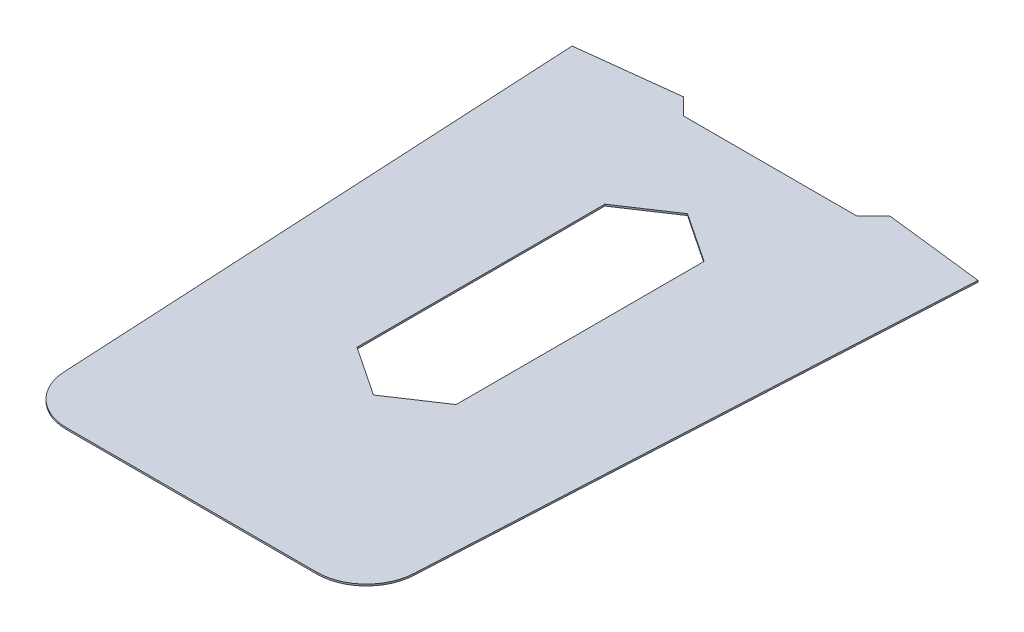
ISO-10303-21;
HEADER;
FILE_DESCRIPTION(('STEP AP214'),'2;1');
FILE_NAME('part.step','',(''),(''),'','','');
FILE_SCHEMA(('AUTOMOTIVE_DESIGN { 1 0 10303 214 1 1 1 1 }'));
ENDSEC;
DATA;
#1=APPLICATION_CONTEXT('core data for automotive mechanical design processes');
#2=APPLICATION_PROTOCOL_DEFINITION('international standard','automotive_design',2000,#1);
#3=PRODUCT_CONTEXT('',#1,'mechanical');
#4=PRODUCT('Part','Part','',(#3));
#5=PRODUCT_RELATED_PRODUCT_CATEGORY('part','',(#4));
#6=PRODUCT_DEFINITION_FORMATION('','',#4);
#7=PRODUCT_DEFINITION_CONTEXT('part definition',#1,'design');
#8=PRODUCT_DEFINITION('design','',#6,#7);
#9=PRODUCT_DEFINITION_SHAPE('','',#8);
#10=(LENGTH_UNIT() NAMED_UNIT(*) SI_UNIT(.MILLI.,.METRE.));
#11=(NAMED_UNIT(*) PLANE_ANGLE_UNIT() SI_UNIT($,.RADIAN.));
#12=(NAMED_UNIT(*) SI_UNIT($,.STERADIAN.) SOLID_ANGLE_UNIT());
#13=UNCERTAINTY_MEASURE_WITH_UNIT(LENGTH_MEASURE(1.E-05),#10,'distance_accuracy_value','');
#14=(GEOMETRIC_REPRESENTATION_CONTEXT(3) GLOBAL_UNCERTAINTY_ASSIGNED_CONTEXT((#13)) GLOBAL_UNIT_ASSIGNED_CONTEXT((#10,
#11,#12)) REPRESENTATION_CONTEXT('',''));
#15=CARTESIAN_POINT('',(0.,0.,0.));
#16=DIRECTION('',(0.,0.,1.));
#17=DIRECTION('',(1.,0.,0.));
#18=AXIS2_PLACEMENT_3D('',#15,#16,#17);
#19=CARTESIAN_POINT('',(96.1998979896957,1.27,222.25));
#20=DIRECTION('',(0.,-1.,0.));
#21=DIRECTION('',(0.,0.,-1.));
#22=AXIS2_PLACEMENT_3D('',#19,#20,#21);
#23=PLANE('',#22);
#24=CARTESIAN_POINT('',(96.1998979896957,1.27,222.25));
#25=DIRECTION('',(0.,1.,0.));
#26=DIRECTION('',(0.,0.,-1.));
#27=AXIS2_PLACEMENT_3D('',#24,#25,#26);
#28=CIRCLE('',#27,38.1);
#29=CARTESIAN_POINT('',(96.1998979896957,1.27,260.35));
#30=VERTEX_POINT('',#29);
#31=CARTESIAN_POINT('',(134.247237287264,1.27,224.252491541977));
#32=VERTEX_POINT('',#31);
#33=EDGE_CURVE('E196',#30,#32,#28,.T.);
#34=ORIENTED_EDGE('',*,*,#33,.T.);
#35=DIRECTION('',(0.0525588331227637,0.,-0.99861782933251));
#36=VECTOR('',#35,1.);
#37=CARTESIAN_POINT('',(139.7,1.27,120.65));
#38=LINE('',#37,#36);
#39=CARTESIAN_POINT('',(155.939618828101,1.27,-187.902757733923));
#40=VERTEX_POINT('',#39);
#41=EDGE_CURVE('E199',#32,#40,#38,.T.);
#42=ORIENTED_EDGE('',*,*,#41,.T.);
#43=DIRECTION('',(-0.993241166947467,0.,-0.11606887731358));
#44=VECTOR('',#43,1.);
#45=CARTESIAN_POINT('',(79.375,1.27,-196.85));
#46=LINE('',#45,#44);
#47=CARTESIAN_POINT('',(79.375,1.27,-196.85));
#48=VERTEX_POINT('',#47);
#49=EDGE_CURVE('E202',#40,#48,#46,.T.);
#50=ORIENTED_EDGE('',*,*,#49,.T.);
#51=DIRECTION('',(-0.707106781186547,0.,0.707106781186548));
#52=VECTOR('',#51,1.);
#53=CARTESIAN_POINT('',(66.675,1.27,-184.15));
#54=LINE('',#53,#52);
#55=CARTESIAN_POINT('',(66.675,1.27,-184.15));
#56=VERTEX_POINT('',#55);
#57=EDGE_CURVE('E204',#48,#56,#54,.T.);
#58=ORIENTED_EDGE('',*,*,#57,.T.);
#59=DIRECTION('',(-1.,0.,0.));
#60=VECTOR('',#59,1.);
#61=CARTESIAN_POINT('',(0.,1.27,-184.15));
#62=LINE('',#61,#60);
#63=CARTESIAN_POINT('',(-66.675,1.27,-184.15));
#64=VERTEX_POINT('',#63);
#65=EDGE_CURVE('E206',#56,#64,#62,.T.);
#66=ORIENTED_EDGE('',*,*,#65,.T.);
#67=DIRECTION('',(-0.707106781186547,0.,-0.707106781186548));
#68=VECTOR('',#67,1.);
#69=CARTESIAN_POINT('',(-66.675,1.27,-184.15));
#70=LINE('',#69,#68);
#71=CARTESIAN_POINT('',(-79.375,1.27,-196.85));
#72=VERTEX_POINT('',#71);
#73=EDGE_CURVE('E208',#64,#72,#70,.T.);
#74=ORIENTED_EDGE('',*,*,#73,.T.);
#75=DIRECTION('',(-0.993241166947467,0.,0.11606887731358));
#76=VECTOR('',#75,1.);
#77=CARTESIAN_POINT('',(-79.375,1.27,-196.85));
#78=LINE('',#77,#76);
#79=CARTESIAN_POINT('',(-155.939618828101,1.27,-187.902757733923));
#80=VERTEX_POINT('',#79);
#81=EDGE_CURVE('E210',#72,#80,#78,.T.);
#82=ORIENTED_EDGE('',*,*,#81,.T.);
#83=DIRECTION('',(0.0525588331227633,0.,0.99861782933251));
#84=VECTOR('',#83,1.);
#85=CARTESIAN_POINT('',(-155.939618828101,1.27,-187.902757733923));
#86=LINE('',#85,#84);
#87=CARTESIAN_POINT('',(-134.247237287264,1.27,224.252491541977));
#88=VERTEX_POINT('',#87);
#89=EDGE_CURVE('E212',#80,#88,#86,.T.);
#90=ORIENTED_EDGE('',*,*,#89,.T.);
#91=CARTESIAN_POINT('',(-96.1998979896957,1.27,222.25));
#92=DIRECTION('',(0.,1.,0.));
#93=DIRECTION('',(0.,0.,1.));
#94=AXIS2_PLACEMENT_3D('',#91,#92,#93);
#95=CIRCLE('',#94,38.1);
#96=CARTESIAN_POINT('',(-96.1998979896957,1.27,260.35));
#97=VERTEX_POINT('',#96);
#98=EDGE_CURVE('E214',#88,#97,#95,.T.);
#99=ORIENTED_EDGE('',*,*,#98,.T.);
#100=DIRECTION('',(1.,0.,0.));
#101=VECTOR('',#100,1.);
#102=CARTESIAN_POINT('',(0.,1.27,260.35));
#103=LINE('',#102,#101);
#104=EDGE_CURVE('E216',#97,#30,#103,.T.);
#105=ORIENTED_EDGE('',*,*,#104,.T.);
#106=EDGE_LOOP('',(#34,#42,#50,#58,#66,#74,#82,#90,#99,#105));
#107=FACE_BOUND('',#106,.T.);
#108=DIRECTION('',(0.832050294337843,0.,-0.55470019622523));
#109=VECTOR('',#108,1.);
#110=CARTESIAN_POINT('',(0.,1.27,120.65));
#111=LINE('',#110,#109);
#112=CARTESIAN_POINT('',(0.,1.27,120.65));
#113=VERTEX_POINT('',#112);
#114=CARTESIAN_POINT('',(38.1,1.27,95.25));
#115=VERTEX_POINT('',#114);
#116=EDGE_CURVE('E145',#113,#115,#111,.T.);
#117=ORIENTED_EDGE('',*,*,#116,.F.);
#118=DIRECTION('',(0.832050294337843,0.,0.55470019622523));
#119=VECTOR('',#118,1.);
#120=CARTESIAN_POINT('',(-38.1,1.27,95.25));
#121=LINE('',#120,#119);
#122=CARTESIAN_POINT('',(-38.1,1.27,95.2499999999999));
#123=VERTEX_POINT('',#122);
#124=EDGE_CURVE('E174',#123,#113,#121,.T.);
#125=ORIENTED_EDGE('',*,*,#124,.F.);
#126=DIRECTION('',(0.,0.,1.));
#127=VECTOR('',#126,1.);
#128=CARTESIAN_POINT('',(-38.1,1.27,-95.25));
#129=LINE('',#128,#127);
#130=CARTESIAN_POINT('',(-38.1,1.27,-95.25));
#131=VERTEX_POINT('',#130);
#132=EDGE_CURVE('E172',#131,#123,#129,.T.);
#133=ORIENTED_EDGE('',*,*,#132,.F.);
#134=DIRECTION('',(-0.832050294337844,0.,0.554700196225229));
#135=VECTOR('',#134,1.);
#136=CARTESIAN_POINT('',(-38.1,1.27,-95.25));
#137=LINE('',#136,#135);
#138=CARTESIAN_POINT('',(0.,1.27,-120.65));
#139=VERTEX_POINT('',#138);
#140=EDGE_CURVE('E168',#139,#131,#137,.T.);
#141=ORIENTED_EDGE('',*,*,#140,.F.);
#142=DIRECTION('',(-0.832050294337844,0.,-0.554700196225229));
#143=VECTOR('',#142,1.);
#144=CARTESIAN_POINT('',(0.,1.27,-120.65));
#145=LINE('',#144,#143);
#146=CARTESIAN_POINT('',(38.1,1.27,-95.25));
#147=VERTEX_POINT('',#146);
#148=EDGE_CURVE('E166',#147,#139,#145,.T.);
#149=ORIENTED_EDGE('',*,*,#148,.F.);
#150=DIRECTION('',(0.,0.,-1.));
#151=VECTOR('',#150,1.);
#152=CARTESIAN_POINT('',(38.1,1.27,-95.25));
#153=LINE('',#152,#151);
#154=EDGE_CURVE('E153',#115,#147,#153,.T.);
#155=ORIENTED_EDGE('',*,*,#154,.F.);
#156=EDGE_LOOP('',(#117,#125,#133,#141,#149,#155));
#157=FACE_BOUND('',#156,.T.);
#158=ADVANCED_FACE('F32',(#107,#157),#23,.F.);
#159=CARTESIAN_POINT('',(96.1998979896957,0.,222.25));
#160=DIRECTION('',(0.,-1.,0.));
#161=DIRECTION('',(0.,0.,-1.));
#162=AXIS2_PLACEMENT_3D('',#159,#160,#161);
#163=PLANE('',#162);
#164=CARTESIAN_POINT('',(96.1998979896957,0.,222.25));
#165=DIRECTION('',(0.,1.,0.));
#166=DIRECTION('',(0.,0.,-1.));
#167=AXIS2_PLACEMENT_3D('',#164,#165,#166);
#168=CIRCLE('',#167,38.1);
#169=CARTESIAN_POINT('',(96.1998979896957,0.,260.35));
#170=VERTEX_POINT('',#169);
#171=CARTESIAN_POINT('',(134.247237287264,0.,224.252491541977));
#172=VERTEX_POINT('',#171);
#173=EDGE_CURVE('E161',#170,#172,#168,.T.);
#174=ORIENTED_EDGE('',*,*,#173,.F.);
#175=DIRECTION('',(1.,0.,0.));
#176=VECTOR('',#175,1.);
#177=CARTESIAN_POINT('',(96.1998979896957,0.,260.35));
#178=LINE('',#177,#176);
#179=CARTESIAN_POINT('',(-96.1998979896957,0.,260.35));
#180=VERTEX_POINT('',#179);
#181=EDGE_CURVE('E200',#180,#170,#178,.T.);
#182=ORIENTED_EDGE('',*,*,#181,.F.);
#183=CARTESIAN_POINT('',(-96.1998979896957,0.,222.25));
#184=DIRECTION('',(0.,1.,0.));
#185=DIRECTION('',(0.,0.,1.));
#186=AXIS2_PLACEMENT_3D('',#183,#184,#185);
#187=CIRCLE('',#186,38.1);
#188=CARTESIAN_POINT('',(-134.247237287264,0.,224.252491541977));
#189=VERTEX_POINT('',#188);
#190=EDGE_CURVE('E237',#189,#180,#187,.T.);
#191=ORIENTED_EDGE('',*,*,#190,.F.);
#192=DIRECTION('',(0.052558833122764,0.,0.99861782933251));
#193=VECTOR('',#192,1.);
#194=CARTESIAN_POINT('',(-139.7,0.,120.65));
#195=LINE('',#194,#193);
#196=CARTESIAN_POINT('',(-155.939618828101,0.,-187.902757733923));
#197=VERTEX_POINT('',#196);
#198=EDGE_CURVE('E235',#197,#189,#195,.T.);
#199=ORIENTED_EDGE('',*,*,#198,.F.);
#200=DIRECTION('',(-0.993241166947467,0.,0.11606887731358));
#201=VECTOR('',#200,1.);
#202=CARTESIAN_POINT('',(-79.375,0.,-196.85));
#203=LINE('',#202,#201);
#204=CARTESIAN_POINT('',(-79.375,0.,-196.85));
#205=VERTEX_POINT('',#204);
#206=EDGE_CURVE('E232',#205,#197,#203,.T.);
#207=ORIENTED_EDGE('',*,*,#206,.F.);
#208=DIRECTION('',(-0.707106781186547,0.,-0.707106781186548));
#209=VECTOR('',#208,1.);
#210=CARTESIAN_POINT('',(-66.675,0.,-184.15));
#211=LINE('',#210,#209);
#212=CARTESIAN_POINT('',(-66.675,0.,-184.15));
#213=VERTEX_POINT('',#212);
#214=EDGE_CURVE('E230',#213,#205,#211,.T.);
#215=ORIENTED_EDGE('',*,*,#214,.F.);
#216=DIRECTION('',(-1.,0.,0.));
#217=VECTOR('',#216,1.);
#218=CARTESIAN_POINT('',(0.,0.,-184.15));
#219=LINE('',#218,#217);
#220=CARTESIAN_POINT('',(66.675,0.,-184.15));
#221=VERTEX_POINT('',#220);
#222=EDGE_CURVE('E228',#221,#213,#219,.T.);
#223=ORIENTED_EDGE('',*,*,#222,.F.);
#224=DIRECTION('',(-0.707106781186547,0.,0.707106781186548));
#225=VECTOR('',#224,1.);
#226=CARTESIAN_POINT('',(66.675,0.,-184.15));
#227=LINE('',#226,#225);
#228=CARTESIAN_POINT('',(79.375,0.,-196.85));
#229=VERTEX_POINT('',#228);
#230=EDGE_CURVE('E225',#229,#221,#227,.T.);
#231=ORIENTED_EDGE('',*,*,#230,.F.);
#232=DIRECTION('',(-0.993241166947467,0.,-0.11606887731358));
#233=VECTOR('',#232,1.);
#234=CARTESIAN_POINT('',(79.375,0.,-196.85));
#235=LINE('',#234,#233);
#236=CARTESIAN_POINT('',(155.939618828101,0.,-187.902757733923));
#237=VERTEX_POINT('',#236);
#238=EDGE_CURVE('E223',#237,#229,#235,.T.);
#239=ORIENTED_EDGE('',*,*,#238,.F.);
#240=DIRECTION('',(0.0525588331227637,0.,-0.99861782933251));
#241=VECTOR('',#240,1.);
#242=CARTESIAN_POINT('',(155.939618828101,0.,-187.902757733923));
#243=LINE('',#242,#241);
#244=EDGE_CURVE('E221',#172,#237,#243,.T.);
#245=ORIENTED_EDGE('',*,*,#244,.F.);
#246=EDGE_LOOP('',(#174,#182,#191,#199,#207,#215,#223,#231,#239,#245));
#247=FACE_BOUND('',#246,.T.);
#248=DIRECTION('',(0.832050294337843,0.,0.55470019622523));
#249=VECTOR('',#248,1.);
#250=CARTESIAN_POINT('',(-38.1,0.,95.25));
#251=LINE('',#250,#249);
#252=CARTESIAN_POINT('',(-38.1,0.,95.25));
#253=VERTEX_POINT('',#252);
#254=CARTESIAN_POINT('',(0.,0.,120.65));
#255=VERTEX_POINT('',#254);
#256=EDGE_CURVE('E154',#253,#255,#251,.T.);
#257=ORIENTED_EDGE('',*,*,#256,.T.);
#258=DIRECTION('',(0.832050294337843,0.,-0.55470019622523));
#259=VECTOR('',#258,1.);
#260=CARTESIAN_POINT('',(0.,0.,120.65));
#261=LINE('',#260,#259);
#262=CARTESIAN_POINT('',(38.1,0.,95.25));
#263=VERTEX_POINT('',#262);
#264=EDGE_CURVE('E55',#255,#263,#261,.T.);
#265=ORIENTED_EDGE('',*,*,#264,.T.);
#266=DIRECTION('',(0.,0.,-1.));
#267=VECTOR('',#266,1.);
#268=CARTESIAN_POINT('',(38.1,0.,-95.25));
#269=LINE('',#268,#267);
#270=CARTESIAN_POINT('',(38.1,0.,-95.25));
#271=VERTEX_POINT('',#270);
#272=EDGE_CURVE('E160',#263,#271,#269,.T.);
#273=ORIENTED_EDGE('',*,*,#272,.T.);
#274=DIRECTION('',(-0.832050294337844,0.,-0.554700196225229));
#275=VECTOR('',#274,1.);
#276=CARTESIAN_POINT('',(0.,0.,-120.65));
#277=LINE('',#276,#275);
#278=CARTESIAN_POINT('',(0.,0.,-120.65));
#279=VERTEX_POINT('',#278);
#280=EDGE_CURVE('E178',#271,#279,#277,.T.);
#281=ORIENTED_EDGE('',*,*,#280,.T.);
#282=DIRECTION('',(-0.832050294337844,0.,0.554700196225229));
#283=VECTOR('',#282,1.);
#284=CARTESIAN_POINT('',(-38.1,0.,-95.25));
#285=LINE('',#284,#283);
#286=CARTESIAN_POINT('',(-38.1,0.,-95.25));
#287=VERTEX_POINT('',#286);
#288=EDGE_CURVE('E181',#279,#287,#285,.T.);
#289=ORIENTED_EDGE('',*,*,#288,.T.);
#290=DIRECTION('',(0.,0.,1.));
#291=VECTOR('',#290,1.);
#292=CARTESIAN_POINT('',(-38.1,0.,-95.25));
#293=LINE('',#292,#291);
#294=EDGE_CURVE('E184',#287,#253,#293,.T.);
#295=ORIENTED_EDGE('',*,*,#294,.T.);
#296=EDGE_LOOP('',(#257,#265,#273,#281,#289,#295));
#297=FACE_BOUND('',#296,.T.);
#298=ADVANCED_FACE('F274',(#247,#297),#163,.T.);
#299=CARTESIAN_POINT('',(96.1998979896957,1.27,222.25));
#300=DIRECTION('',(0.,-1.,0.));
#301=DIRECTION('',(0.,0.,-1.));
#302=AXIS2_PLACEMENT_3D('',#299,#300,#301);
#303=CYLINDRICAL_SURFACE('',#302,38.1);
#304=ORIENTED_EDGE('',*,*,#173,.T.);
#305=DIRECTION('',(0.,-1.,0.));
#306=VECTOR('',#305,1.);
#307=CARTESIAN_POINT('',(134.247237287264,1.27,224.252491541977));
#308=LINE('',#307,#306);
#309=EDGE_CURVE('E11',#32,#172,#308,.T.);
#310=ORIENTED_EDGE('',*,*,#309,.F.);
#311=ORIENTED_EDGE('',*,*,#33,.F.);
#312=DIRECTION('',(0.,-1.,0.));
#313=VECTOR('',#312,1.);
#314=CARTESIAN_POINT('',(96.1998979896957,1.27,260.35));
#315=LINE('',#314,#313);
#316=EDGE_CURVE('E218',#30,#170,#315,.T.);
#317=ORIENTED_EDGE('',*,*,#316,.T.);
#318=EDGE_LOOP('',(#304,#310,#311,#317));
#319=FACE_BOUND('',#318,.T.);
#320=ADVANCED_FACE('F34',(#319),#303,.T.);
#321=CARTESIAN_POINT('',(155.939618828101,1.27,-187.902757733923));
#322=DIRECTION('',(-0.99861782933251,0.,-0.0525588331227637));
#323=DIRECTION('',(-0.0525588331227637,0.,0.99861782933251));
#324=AXIS2_PLACEMENT_3D('',#321,#322,#323);
#325=PLANE('',#324);
#326=ORIENTED_EDGE('',*,*,#244,.T.);
#327=DIRECTION('',(0.,-1.,0.));
#328=VECTOR('',#327,1.);
#329=CARTESIAN_POINT('',(155.939618828101,1.27,-187.902757733923));
#330=LINE('',#329,#328);
#331=EDGE_CURVE('E40',#40,#237,#330,.T.);
#332=ORIENTED_EDGE('',*,*,#331,.F.);
#333=ORIENTED_EDGE('',*,*,#41,.F.);
#334=ORIENTED_EDGE('',*,*,#309,.T.);
#335=EDGE_LOOP('',(#326,#332,#333,#334));
#336=FACE_BOUND('',#335,.T.);
#337=ADVANCED_FACE('F290',(#336),#325,.F.);
#338=CARTESIAN_POINT('',(79.375,1.27,-196.85));
#339=DIRECTION('',(-0.11606887731358,0.,0.993241166947466));
#340=DIRECTION('',(0.993241166947467,0.,0.11606887731358));
#341=AXIS2_PLACEMENT_3D('',#338,#339,#340);
#342=PLANE('',#341);
#343=ORIENTED_EDGE('',*,*,#238,.T.);
#344=DIRECTION('',(0.,-1.,0.));
#345=VECTOR('',#344,1.);
#346=CARTESIAN_POINT('',(79.375,1.27,-196.85));
#347=LINE('',#346,#345);
#348=EDGE_CURVE('E261',#48,#229,#347,.T.);
#349=ORIENTED_EDGE('',*,*,#348,.F.);
#350=ORIENTED_EDGE('',*,*,#49,.F.);
#351=ORIENTED_EDGE('',*,*,#331,.T.);
#352=EDGE_LOOP('',(#343,#349,#350,#351));
#353=FACE_BOUND('',#352,.T.);
#354=ADVANCED_FACE('F268',(#353),#342,.F.);
#355=CARTESIAN_POINT('',(66.675,1.27,-184.15));
#356=DIRECTION('',(0.707106781186548,0.,0.707106781186547));
#357=DIRECTION('',(0.707106781186547,0.,-0.707106781186548));
#358=AXIS2_PLACEMENT_3D('',#355,#356,#357);
#359=PLANE('',#358);
#360=ORIENTED_EDGE('',*,*,#230,.T.);
#361=DIRECTION('',(0.,-1.,0.));
#362=VECTOR('',#361,1.);
#363=CARTESIAN_POINT('',(66.675,1.27,-184.15));
#364=LINE('',#363,#362);
#365=EDGE_CURVE('E258',#56,#221,#364,.T.);
#366=ORIENTED_EDGE('',*,*,#365,.F.);
#367=ORIENTED_EDGE('',*,*,#57,.F.);
#368=ORIENTED_EDGE('',*,*,#348,.T.);
#369=EDGE_LOOP('',(#360,#366,#367,#368));
#370=FACE_BOUND('',#369,.T.);
#371=ADVANCED_FACE('F279',(#370),#359,.F.);
#372=CARTESIAN_POINT('',(0.,1.27,-184.15));
#373=DIRECTION('',(0.,0.,1.));
#374=DIRECTION('',(1.,0.,0.));
#375=AXIS2_PLACEMENT_3D('',#372,#373,#374);
#376=PLANE('',#375);
#377=ORIENTED_EDGE('',*,*,#222,.T.);
#378=DIRECTION('',(0.,-1.,0.));
#379=VECTOR('',#378,1.);
#380=CARTESIAN_POINT('',(-66.675,1.27,-184.15));
#381=LINE('',#380,#379);
#382=EDGE_CURVE('E255',#64,#213,#381,.T.);
#383=ORIENTED_EDGE('',*,*,#382,.F.);
#384=ORIENTED_EDGE('',*,*,#65,.F.);
#385=ORIENTED_EDGE('',*,*,#365,.T.);
#386=EDGE_LOOP('',(#377,#383,#384,#385));
#387=FACE_BOUND('',#386,.T.);
#388=ADVANCED_FACE('F283',(#387),#376,.F.);
#389=CARTESIAN_POINT('',(-66.675,1.27,-184.15));
#390=DIRECTION('',(-0.707106781186548,0.,0.707106781186547));
#391=DIRECTION('',(0.707106781186547,0.,0.707106781186548));
#392=AXIS2_PLACEMENT_3D('',#389,#390,#391);
#393=PLANE('',#392);
#394=ORIENTED_EDGE('',*,*,#214,.T.);
#395=DIRECTION('',(0.,-1.,0.));
#396=VECTOR('',#395,1.);
#397=CARTESIAN_POINT('',(-79.375,1.27,-196.85));
#398=LINE('',#397,#396);
#399=EDGE_CURVE('E252',#72,#205,#398,.T.);
#400=ORIENTED_EDGE('',*,*,#399,.F.);
#401=ORIENTED_EDGE('',*,*,#73,.F.);
#402=ORIENTED_EDGE('',*,*,#382,.T.);
#403=EDGE_LOOP('',(#394,#400,#401,#402));
#404=FACE_BOUND('',#403,.T.);
#405=ADVANCED_FACE('F311',(#404),#393,.F.);
#406=CARTESIAN_POINT('',(-79.375,1.27,-196.85));
#407=DIRECTION('',(0.11606887731358,0.,0.993241166947466));
#408=DIRECTION('',(0.993241166947467,0.,-0.11606887731358));
#409=AXIS2_PLACEMENT_3D('',#406,#407,#408);
#410=PLANE('',#409);
#411=ORIENTED_EDGE('',*,*,#206,.T.);
#412=DIRECTION('',(0.,-1.,0.));
#413=VECTOR('',#412,1.);
#414=CARTESIAN_POINT('',(-155.939618828101,1.27,-187.902757733923));
#415=LINE('',#414,#413);
#416=EDGE_CURVE('E249',#80,#197,#415,.T.);
#417=ORIENTED_EDGE('',*,*,#416,.F.);
#418=ORIENTED_EDGE('',*,*,#81,.F.);
#419=ORIENTED_EDGE('',*,*,#399,.T.);
#420=EDGE_LOOP('',(#411,#417,#418,#419));
#421=FACE_BOUND('',#420,.T.);
#422=ADVANCED_FACE('F309',(#421),#410,.F.);
#423=CARTESIAN_POINT('',(-139.7,1.27,120.65));
#424=DIRECTION('',(0.99861782933251,0.,-0.052558833122764));
#425=DIRECTION('',(-0.052558833122764,0.,-0.99861782933251));
#426=AXIS2_PLACEMENT_3D('',#423,#424,#425);
#427=PLANE('',#426);
#428=ORIENTED_EDGE('',*,*,#198,.T.);
#429=DIRECTION('',(0.,-1.,0.));
#430=VECTOR('',#429,1.);
#431=CARTESIAN_POINT('',(-134.247237287264,1.27,224.252491541977));
#432=LINE('',#431,#430);
#433=EDGE_CURVE('E246',#88,#189,#432,.T.);
#434=ORIENTED_EDGE('',*,*,#433,.F.);
#435=ORIENTED_EDGE('',*,*,#89,.F.);
#436=ORIENTED_EDGE('',*,*,#416,.T.);
#437=EDGE_LOOP('',(#428,#434,#435,#436));
#438=FACE_BOUND('',#437,.T.);
#439=ADVANCED_FACE('F306',(#438),#427,.F.);
#440=CARTESIAN_POINT('',(-96.1998979896957,1.27,222.25));
#441=DIRECTION('',(0.,-1.,0.));
#442=DIRECTION('',(0.,0.,-1.));
#443=AXIS2_PLACEMENT_3D('',#440,#441,#442);
#444=CYLINDRICAL_SURFACE('',#443,38.1);
#445=ORIENTED_EDGE('',*,*,#190,.T.);
#446=DIRECTION('',(0.,-1.,0.));
#447=VECTOR('',#446,1.);
#448=CARTESIAN_POINT('',(-96.1998979896957,1.27,260.35));
#449=LINE('',#448,#447);
#450=EDGE_CURVE('E243',#97,#180,#449,.T.);
#451=ORIENTED_EDGE('',*,*,#450,.F.);
#452=ORIENTED_EDGE('',*,*,#98,.F.);
#453=ORIENTED_EDGE('',*,*,#433,.T.);
#454=EDGE_LOOP('',(#445,#451,#452,#453));
#455=FACE_BOUND('',#454,.T.);
#456=ADVANCED_FACE('F297',(#455),#444,.T.);
#457=CARTESIAN_POINT('',(96.1998979896957,1.27,260.35));
#458=DIRECTION('',(0.,0.,-1.));
#459=DIRECTION('',(-1.,0.,0.));
#460=AXIS2_PLACEMENT_3D('',#457,#458,#459);
#461=PLANE('',#460);
#462=ORIENTED_EDGE('',*,*,#181,.T.);
#463=ORIENTED_EDGE('',*,*,#316,.F.);
#464=ORIENTED_EDGE('',*,*,#104,.F.);
#465=ORIENTED_EDGE('',*,*,#450,.T.);
#466=EDGE_LOOP('',(#462,#463,#464,#465));
#467=FACE_BOUND('',#466,.T.);
#468=ADVANCED_FACE('F301',(#467),#461,.F.);
#469=CARTESIAN_POINT('',(0.,1.27,120.65));
#470=DIRECTION('',(-0.55470019622523,0.,-0.832050294337843));
#471=DIRECTION('',(-0.832050294337843,0.,0.55470019622523));
#472=AXIS2_PLACEMENT_3D('',#469,#470,#471);
#473=PLANE('',#472);
#474=ORIENTED_EDGE('',*,*,#264,.F.);
#475=DIRECTION('',(0.,-1.,0.));
#476=VECTOR('',#475,1.);
#477=CARTESIAN_POINT('',(0.,1.27,120.65));
#478=LINE('',#477,#476);
#479=EDGE_CURVE('E149',#113,#255,#478,.T.);
#480=ORIENTED_EDGE('',*,*,#479,.F.);
#481=ORIENTED_EDGE('',*,*,#116,.T.);
#482=DIRECTION('',(0.,-1.,0.));
#483=VECTOR('',#482,1.);
#484=CARTESIAN_POINT('',(38.1,1.27,95.25));
#485=LINE('',#484,#483);
#486=EDGE_CURVE('E148',#115,#263,#485,.T.);
#487=ORIENTED_EDGE('',*,*,#486,.T.);
#488=EDGE_LOOP('',(#474,#480,#481,#487));
#489=FACE_BOUND('',#488,.T.);
#490=ADVANCED_FACE('F147',(#489),#473,.T.);
#491=CARTESIAN_POINT('',(38.1,1.27,-95.25));
#492=DIRECTION('',(-1.,0.,0.));
#493=DIRECTION('',(0.,0.,1.));
#494=AXIS2_PLACEMENT_3D('',#491,#492,#493);
#495=PLANE('',#494);
#496=ORIENTED_EDGE('',*,*,#272,.F.);
#497=ORIENTED_EDGE('',*,*,#486,.F.);
#498=ORIENTED_EDGE('',*,*,#154,.T.);
#499=DIRECTION('',(0.,-1.,0.));
#500=VECTOR('',#499,1.);
#501=CARTESIAN_POINT('',(38.1,1.27,-95.25));
#502=LINE('',#501,#500);
#503=EDGE_CURVE('E162',#147,#271,#502,.T.);
#504=ORIENTED_EDGE('',*,*,#503,.T.);
#505=EDGE_LOOP('',(#496,#497,#498,#504));
#506=FACE_BOUND('',#505,.T.);
#507=ADVANCED_FACE('F157',(#506),#495,.T.);
#508=CARTESIAN_POINT('',(0.,1.27,-120.65));
#509=DIRECTION('',(-0.554700196225229,0.,0.832050294337844));
#510=DIRECTION('',(0.832050294337844,0.,0.554700196225229));
#511=AXIS2_PLACEMENT_3D('',#508,#509,#510);
#512=PLANE('',#511);
#513=ORIENTED_EDGE('',*,*,#280,.F.);
#514=ORIENTED_EDGE('',*,*,#503,.F.);
#515=ORIENTED_EDGE('',*,*,#148,.T.);
#516=DIRECTION('',(0.,-1.,0.));
#517=VECTOR('',#516,1.);
#518=CARTESIAN_POINT('',(0.,1.27,-120.65));
#519=LINE('',#518,#517);
#520=EDGE_CURVE('E193',#139,#279,#519,.T.);
#521=ORIENTED_EDGE('',*,*,#520,.T.);
#522=EDGE_LOOP('',(#513,#514,#515,#521));
#523=FACE_BOUND('',#522,.T.);
#524=ADVANCED_FACE('F357',(#523),#512,.T.);
#525=CARTESIAN_POINT('',(-38.1,1.27,-95.25));
#526=DIRECTION('',(0.554700196225229,0.,0.832050294337844));
#527=DIRECTION('',(0.832050294337844,0.,-0.554700196225229));
#528=AXIS2_PLACEMENT_3D('',#525,#526,#527);
#529=PLANE('',#528);
#530=ORIENTED_EDGE('',*,*,#288,.F.);
#531=ORIENTED_EDGE('',*,*,#520,.F.);
#532=ORIENTED_EDGE('',*,*,#140,.T.);
#533=DIRECTION('',(0.,-1.,0.));
#534=VECTOR('',#533,1.);
#535=CARTESIAN_POINT('',(-38.1,1.27,-95.25));
#536=LINE('',#535,#534);
#537=EDGE_CURVE('E191',#131,#287,#536,.T.);
#538=ORIENTED_EDGE('',*,*,#537,.T.);
#539=EDGE_LOOP('',(#530,#531,#532,#538));
#540=FACE_BOUND('',#539,.T.);
#541=ADVANCED_FACE('F363',(#540),#529,.T.);
#542=CARTESIAN_POINT('',(-38.1,1.27,-95.25));
#543=DIRECTION('',(1.,0.,0.));
#544=DIRECTION('',(0.,0.,-1.));
#545=AXIS2_PLACEMENT_3D('',#542,#543,#544);
#546=PLANE('',#545);
#547=ORIENTED_EDGE('',*,*,#294,.F.);
#548=ORIENTED_EDGE('',*,*,#537,.F.);
#549=ORIENTED_EDGE('',*,*,#132,.T.);
#550=DIRECTION('',(0.,-1.,0.));
#551=VECTOR('',#550,1.);
#552=CARTESIAN_POINT('',(-38.1,1.27,95.25));
#553=LINE('',#552,#551);
#554=EDGE_CURVE('E47',#123,#253,#553,.T.);
#555=ORIENTED_EDGE('',*,*,#554,.T.);
#556=EDGE_LOOP('',(#547,#548,#549,#555));
#557=FACE_BOUND('',#556,.T.);
#558=ADVANCED_FACE('F371',(#557),#546,.T.);
#559=CARTESIAN_POINT('',(-38.1,1.27,95.25));
#560=DIRECTION('',(0.55470019622523,0.,-0.832050294337843));
#561=DIRECTION('',(-0.832050294337843,0.,-0.55470019622523));
#562=AXIS2_PLACEMENT_3D('',#559,#560,#561);
#563=PLANE('',#562);
#564=ORIENTED_EDGE('',*,*,#256,.F.);
#565=ORIENTED_EDGE('',*,*,#554,.F.);
#566=ORIENTED_EDGE('',*,*,#124,.T.);
#567=ORIENTED_EDGE('',*,*,#479,.T.);
#568=EDGE_LOOP('',(#564,#565,#566,#567));
#569=FACE_BOUND('',#568,.T.);
#570=ADVANCED_FACE('F379',(#569),#563,.T.);
#571=CLOSED_SHELL('',(#158,#298,#320,#337,#354,#371,#388,#405,#422,#439,#456,#468,#490,#507,
#524,#541,#558,#570));
#572=MANIFOLD_SOLID_BREP('B2',#571);
#573=ADVANCED_BREP_SHAPE_REPRESENTATION('',(#18,#572),#14);
#574=SHAPE_DEFINITION_REPRESENTATION(#9,#573);
ENDSEC;
END-ISO-10303-21;
